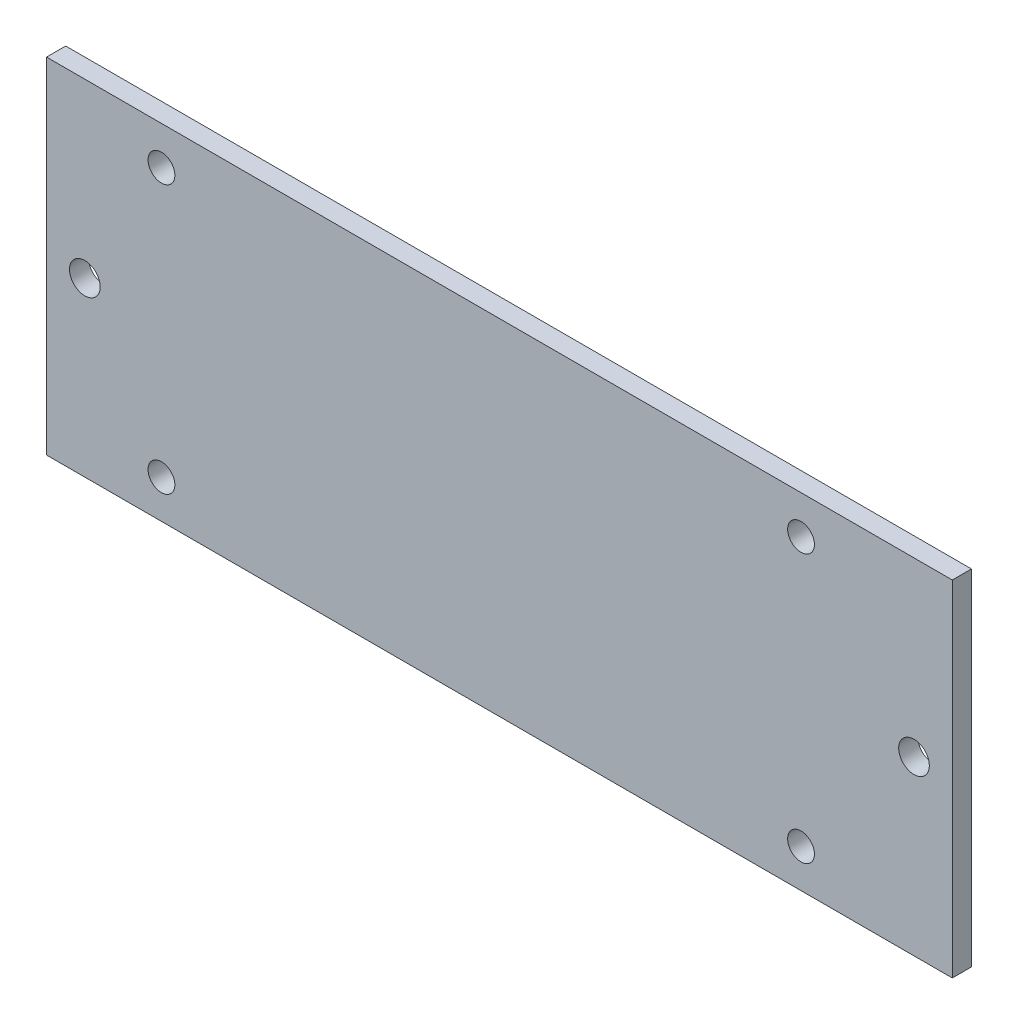
ISO-10303-21;
HEADER;
FILE_DESCRIPTION(('STEP AP214'),'2;1');
FILE_NAME('part.step','',(''),(''),'','','');
FILE_SCHEMA(('AUTOMOTIVE_DESIGN { 1 0 10303 214 1 1 1 1 }'));
ENDSEC;
DATA;
#1=APPLICATION_CONTEXT('core data for automotive mechanical design processes');
#2=APPLICATION_PROTOCOL_DEFINITION('international standard','automotive_design',2000,#1);
#3=PRODUCT_CONTEXT('',#1,'mechanical');
#4=PRODUCT('Part','Part','',(#3));
#5=PRODUCT_RELATED_PRODUCT_CATEGORY('part','',(#4));
#6=PRODUCT_DEFINITION_FORMATION('','',#4);
#7=PRODUCT_DEFINITION_CONTEXT('part definition',#1,'design');
#8=PRODUCT_DEFINITION('design','',#6,#7);
#9=PRODUCT_DEFINITION_SHAPE('','',#8);
#10=(LENGTH_UNIT() NAMED_UNIT(*) SI_UNIT(.MILLI.,.METRE.));
#11=(NAMED_UNIT(*) PLANE_ANGLE_UNIT() SI_UNIT($,.RADIAN.));
#12=(NAMED_UNIT(*) SI_UNIT($,.STERADIAN.) SOLID_ANGLE_UNIT());
#13=UNCERTAINTY_MEASURE_WITH_UNIT(LENGTH_MEASURE(1.E-05),#10,'distance_accuracy_value','');
#14=(GEOMETRIC_REPRESENTATION_CONTEXT(3) GLOBAL_UNCERTAINTY_ASSIGNED_CONTEXT((#13)) GLOBAL_UNIT_ASSIGNED_CONTEXT((#10,
#11,#12)) REPRESENTATION_CONTEXT('',''));
#15=CARTESIAN_POINT('',(0.,0.,0.));
#16=DIRECTION('',(0.,0.,1.));
#17=DIRECTION('',(1.,0.,0.));
#18=AXIS2_PLACEMENT_3D('',#15,#16,#17);
#19=CARTESIAN_POINT('',(-44.9668604651163,18.9503197674418,1.27));
#20=DIRECTION('',(1.,0.,0.));
#21=DIRECTION('',(0.,0.,-1.));
#22=AXIS2_PLACEMENT_3D('',#19,#20,#21);
#23=PLANE('',#22);
#24=DIRECTION('',(0.,-1.,0.));
#25=VECTOR('',#24,1.);
#26=CARTESIAN_POINT('',(-44.9668604651163,18.9503197674418,0.));
#27=LINE('',#26,#25);
#28=CARTESIAN_POINT('',(-44.9668604651163,18.9503197674418,0.));
#29=VERTEX_POINT('',#28);
#30=CARTESIAN_POINT('',(-44.9668604651163,-3.90968023255815,0.));
#31=VERTEX_POINT('',#30);
#32=EDGE_CURVE('E110',#29,#31,#27,.T.);
#33=ORIENTED_EDGE('',*,*,#32,.T.);
#34=DIRECTION('',(0.,0.,-1.));
#35=VECTOR('',#34,1.);
#36=CARTESIAN_POINT('',(-44.9668604651163,-3.90968023255815,1.27));
#37=LINE('',#36,#35);
#38=CARTESIAN_POINT('',(-44.9668604651163,-3.90968023255815,1.27));
#39=VERTEX_POINT('',#38);
#40=EDGE_CURVE('E11',#39,#31,#37,.T.);
#41=ORIENTED_EDGE('',*,*,#40,.F.);
#42=DIRECTION('',(0.,-1.,0.));
#43=VECTOR('',#42,1.);
#44=CARTESIAN_POINT('',(-44.9668604651163,18.9503197674418,1.27));
#45=LINE('',#44,#43);
#46=CARTESIAN_POINT('',(-44.9668604651163,18.9503197674418,1.27));
#47=VERTEX_POINT('',#46);
#48=EDGE_CURVE('E93',#47,#39,#45,.T.);
#49=ORIENTED_EDGE('',*,*,#48,.F.);
#50=DIRECTION('',(0.,0.,-1.));
#51=VECTOR('',#50,1.);
#52=CARTESIAN_POINT('',(-44.9668604651163,18.9503197674418,1.27));
#53=LINE('',#52,#51);
#54=EDGE_CURVE('E106',#47,#29,#53,.T.);
#55=ORIENTED_EDGE('',*,*,#54,.T.);
#56=EDGE_LOOP('',(#33,#41,#49,#55));
#57=FACE_BOUND('',#56,.T.);
#58=ADVANCED_FACE('F39',(#57),#23,.F.);
#59=CARTESIAN_POINT('',(-44.9668604651163,-3.90968023255815,1.27));
#60=DIRECTION('',(0.,1.,0.));
#61=DIRECTION('',(0.,0.,1.));
#62=AXIS2_PLACEMENT_3D('',#59,#60,#61);
#63=PLANE('',#62);
#64=DIRECTION('',(1.,0.,0.));
#65=VECTOR('',#64,1.);
#66=CARTESIAN_POINT('',(-44.9668604651163,-3.90968023255815,0.));
#67=LINE('',#66,#65);
#68=CARTESIAN_POINT('',(15.1041395348837,-3.90968023255815,0.));
#69=VERTEX_POINT('',#68);
#70=EDGE_CURVE('E98',#31,#69,#67,.T.);
#71=ORIENTED_EDGE('',*,*,#70,.T.);
#72=DIRECTION('',(0.,0.,-1.));
#73=VECTOR('',#72,1.);
#74=CARTESIAN_POINT('',(15.1041395348837,-3.90968023255815,1.27));
#75=LINE('',#74,#73);
#76=CARTESIAN_POINT('',(15.1041395348837,-3.90968023255815,1.27));
#77=VERTEX_POINT('',#76);
#78=EDGE_CURVE('E49',#77,#69,#75,.T.);
#79=ORIENTED_EDGE('',*,*,#78,.F.);
#80=DIRECTION('',(1.,0.,0.));
#81=VECTOR('',#80,1.);
#82=CARTESIAN_POINT('',(-44.9668604651163,-3.90968023255815,1.27));
#83=LINE('',#82,#81);
#84=EDGE_CURVE('E88',#39,#77,#83,.T.);
#85=ORIENTED_EDGE('',*,*,#84,.F.);
#86=ORIENTED_EDGE('',*,*,#40,.T.);
#87=EDGE_LOOP('',(#71,#79,#85,#86));
#88=FACE_BOUND('',#87,.T.);
#89=ADVANCED_FACE('F97',(#88),#63,.F.);
#90=CARTESIAN_POINT('',(15.1041395348837,18.9503197674418,1.27));
#91=DIRECTION('',(-1.,0.,0.));
#92=DIRECTION('',(0.,0.,1.));
#93=AXIS2_PLACEMENT_3D('',#90,#91,#92);
#94=PLANE('',#93);
#95=DIRECTION('',(0.,1.,0.));
#96=VECTOR('',#95,1.);
#97=CARTESIAN_POINT('',(15.1041395348837,18.9503197674418,0.));
#98=LINE('',#97,#96);
#99=CARTESIAN_POINT('',(15.1041395348837,18.9503197674418,0.));
#100=VERTEX_POINT('',#99);
#101=EDGE_CURVE('E75',#69,#100,#98,.T.);
#102=ORIENTED_EDGE('',*,*,#101,.T.);
#103=DIRECTION('',(0.,0.,-1.));
#104=VECTOR('',#103,1.);
#105=CARTESIAN_POINT('',(15.1041395348837,18.9503197674418,1.27));
#106=LINE('',#105,#104);
#107=CARTESIAN_POINT('',(15.1041395348837,18.9503197674418,1.27));
#108=VERTEX_POINT('',#107);
#109=EDGE_CURVE('E100',#108,#100,#106,.T.);
#110=ORIENTED_EDGE('',*,*,#109,.F.);
#111=DIRECTION('',(0.,1.,0.));
#112=VECTOR('',#111,1.);
#113=CARTESIAN_POINT('',(15.1041395348837,18.9503197674418,1.27));
#114=LINE('',#113,#112);
#115=EDGE_CURVE('E91',#77,#108,#114,.T.);
#116=ORIENTED_EDGE('',*,*,#115,.F.);
#117=ORIENTED_EDGE('',*,*,#78,.T.);
#118=EDGE_LOOP('',(#102,#110,#116,#117));
#119=FACE_BOUND('',#118,.T.);
#120=ADVANCED_FACE('F102',(#119),#94,.F.);
#121=CARTESIAN_POINT('',(-44.9668604651163,18.9503197674418,1.27));
#122=DIRECTION('',(0.,-1.,0.));
#123=DIRECTION('',(0.,0.,-1.));
#124=AXIS2_PLACEMENT_3D('',#121,#122,#123);
#125=PLANE('',#124);
#126=DIRECTION('',(-1.,0.,0.));
#127=VECTOR('',#126,1.);
#128=CARTESIAN_POINT('',(-44.9668604651163,18.9503197674418,0.));
#129=LINE('',#128,#127);
#130=EDGE_CURVE('E81',#100,#29,#129,.T.);
#131=ORIENTED_EDGE('',*,*,#130,.T.);
#132=ORIENTED_EDGE('',*,*,#54,.F.);
#133=DIRECTION('',(-1.,0.,0.));
#134=VECTOR('',#133,1.);
#135=CARTESIAN_POINT('',(-44.9668604651163,18.9503197674418,1.27));
#136=LINE('',#135,#134);
#137=EDGE_CURVE('E58',#108,#47,#136,.T.);
#138=ORIENTED_EDGE('',*,*,#137,.F.);
#139=ORIENTED_EDGE('',*,*,#109,.T.);
#140=EDGE_LOOP('',(#131,#132,#138,#139));
#141=FACE_BOUND('',#140,.T.);
#142=ADVANCED_FACE('F180',(#141),#125,.F.);
#143=CARTESIAN_POINT('',(0.,0.,1.27));
#144=DIRECTION('',(0.,0.,1.));
#145=DIRECTION('',(1.,0.,0.));
#146=AXIS2_PLACEMENT_3D('',#143,#144,#145);
#147=PLANE('',#146);
#148=CARTESIAN_POINT('',(-42.4268604651163,7.52031976744185,1.27));
#149=DIRECTION('',(0.,0.,1.));
#150=DIRECTION('',(1.,0.,0.));
#151=AXIS2_PLACEMENT_3D('',#148,#149,#150);
#152=CIRCLE('',#151,1.016);
#153=CARTESIAN_POINT('',(-41.4108604651163,7.52031976744185,1.27));
#154=VERTEX_POINT('',#153);
#155=EDGE_CURVE('E129',#154,#154,#152,.T.);
#156=ORIENTED_EDGE('',*,*,#155,.F.);
#157=EDGE_LOOP('',(#156));
#158=FACE_BOUND('',#157,.T.);
#159=CARTESIAN_POINT('',(5.07113953488373,-1.36968023255815,1.27));
#160=DIRECTION('',(0.,0.,1.));
#161=DIRECTION('',(1.,0.,0.));
#162=AXIS2_PLACEMENT_3D('',#159,#160,#161);
#163=CIRCLE('',#162,0.889000000000002);
#164=CARTESIAN_POINT('',(5.96013953488373,-1.36968023255815,1.27));
#165=VERTEX_POINT('',#164);
#166=EDGE_CURVE('E282',#165,#165,#163,.T.);
#167=ORIENTED_EDGE('',*,*,#166,.F.);
#168=EDGE_LOOP('',(#167));
#169=FACE_BOUND('',#168,.T.);
#170=CARTESIAN_POINT('',(12.5641395348837,7.52031976744185,1.27));
#171=DIRECTION('',(0.,0.,1.));
#172=DIRECTION('',(1.,0.,0.));
#173=AXIS2_PLACEMENT_3D('',#170,#171,#172);
#174=CIRCLE('',#173,1.016);
#175=CARTESIAN_POINT('',(13.5801395348837,7.52031976744185,1.27));
#176=VERTEX_POINT('',#175);
#177=EDGE_CURVE('E254',#176,#176,#174,.T.);
#178=ORIENTED_EDGE('',*,*,#177,.F.);
#179=EDGE_LOOP('',(#178));
#180=FACE_BOUND('',#179,.T.);
#181=CARTESIAN_POINT('',(-37.3468604651163,16.4103197674418,1.27));
#182=DIRECTION('',(0.,0.,1.));
#183=DIRECTION('',(1.,0.,0.));
#184=AXIS2_PLACEMENT_3D('',#181,#182,#183);
#185=CIRCLE('',#184,0.889000000000003);
#186=CARTESIAN_POINT('',(-36.4578604651163,16.4103197674418,1.27));
#187=VERTEX_POINT('',#186);
#188=EDGE_CURVE('E268',#187,#187,#185,.T.);
#189=ORIENTED_EDGE('',*,*,#188,.F.);
#190=EDGE_LOOP('',(#189));
#191=FACE_BOUND('',#190,.T.);
#192=CARTESIAN_POINT('',(5.07113953488373,16.4103197674418,1.27));
#193=DIRECTION('',(0.,0.,1.));
#194=DIRECTION('',(1.,0.,0.));
#195=AXIS2_PLACEMENT_3D('',#192,#193,#194);
#196=CIRCLE('',#195,0.889000000000002);
#197=CARTESIAN_POINT('',(5.96013953488373,16.4103197674418,1.27));
#198=VERTEX_POINT('',#197);
#199=EDGE_CURVE('E274',#198,#198,#196,.T.);
#200=ORIENTED_EDGE('',*,*,#199,.F.);
#201=EDGE_LOOP('',(#200));
#202=FACE_BOUND('',#201,.T.);
#203=CARTESIAN_POINT('',(-37.3468604651163,-1.36968023255815,1.27));
#204=DIRECTION('',(0.,0.,1.));
#205=DIRECTION('',(1.,0.,0.));
#206=AXIS2_PLACEMENT_3D('',#203,#204,#205);
#207=CIRCLE('',#206,0.889000000000003);
#208=CARTESIAN_POINT('',(-36.4578604651163,-1.36968023255815,1.27));
#209=VERTEX_POINT('',#208);
#210=EDGE_CURVE('E277',#209,#209,#207,.T.);
#211=ORIENTED_EDGE('',*,*,#210,.F.);
#212=EDGE_LOOP('',(#211));
#213=FACE_BOUND('',#212,.T.);
#214=ORIENTED_EDGE('',*,*,#48,.T.);
#215=ORIENTED_EDGE('',*,*,#84,.T.);
#216=ORIENTED_EDGE('',*,*,#115,.T.);
#217=ORIENTED_EDGE('',*,*,#137,.T.);
#218=EDGE_LOOP('',(#214,#215,#216,#217));
#219=FACE_BOUND('',#218,.T.);
#220=ADVANCED_FACE('F89',(#158,#169,#180,#191,#202,#213,#219),#147,.T.);
#221=CARTESIAN_POINT('',(0.,0.,0.));
#222=DIRECTION('',(0.,0.,1.));
#223=DIRECTION('',(1.,0.,0.));
#224=AXIS2_PLACEMENT_3D('',#221,#222,#223);
#225=PLANE('',#224);
#226=CARTESIAN_POINT('',(-42.4268604651163,7.52031976744185,0.));
#227=DIRECTION('',(0.,0.,1.));
#228=DIRECTION('',(1.,0.,0.));
#229=AXIS2_PLACEMENT_3D('',#226,#227,#228);
#230=CIRCLE('',#229,1.016);
#231=CARTESIAN_POINT('',(-41.4108604651163,7.52031976744185,0.));
#232=VERTEX_POINT('',#231);
#233=EDGE_CURVE('E42',#232,#232,#230,.T.);
#234=ORIENTED_EDGE('',*,*,#233,.T.);
#235=EDGE_LOOP('',(#234));
#236=FACE_BOUND('',#235,.T.);
#237=CARTESIAN_POINT('',(5.07113953488373,-1.36968023255815,0.));
#238=DIRECTION('',(0.,0.,1.));
#239=DIRECTION('',(1.,0.,0.));
#240=AXIS2_PLACEMENT_3D('',#237,#238,#239);
#241=CIRCLE('',#240,0.889000000000002);
#242=CARTESIAN_POINT('',(5.96013953488373,-1.36968023255815,0.));
#243=VERTEX_POINT('',#242);
#244=EDGE_CURVE('E140',#243,#243,#241,.T.);
#245=ORIENTED_EDGE('',*,*,#244,.T.);
#246=EDGE_LOOP('',(#245));
#247=FACE_BOUND('',#246,.T.);
#248=CARTESIAN_POINT('',(12.5641395348837,7.52031976744185,0.));
#249=DIRECTION('',(0.,0.,1.));
#250=DIRECTION('',(1.,0.,0.));
#251=AXIS2_PLACEMENT_3D('',#248,#249,#250);
#252=CIRCLE('',#251,1.016);
#253=CARTESIAN_POINT('',(13.5801395348837,7.52031976744185,0.));
#254=VERTEX_POINT('',#253);
#255=EDGE_CURVE('E137',#254,#254,#252,.T.);
#256=ORIENTED_EDGE('',*,*,#255,.T.);
#257=EDGE_LOOP('',(#256));
#258=FACE_BOUND('',#257,.T.);
#259=CARTESIAN_POINT('',(-37.3468604651163,16.4103197674418,0.));
#260=DIRECTION('',(0.,0.,1.));
#261=DIRECTION('',(1.,0.,0.));
#262=AXIS2_PLACEMENT_3D('',#259,#260,#261);
#263=CIRCLE('',#262,0.889000000000003);
#264=CARTESIAN_POINT('',(-36.4578604651163,16.4103197674418,0.));
#265=VERTEX_POINT('',#264);
#266=EDGE_CURVE('E133',#265,#265,#263,.T.);
#267=ORIENTED_EDGE('',*,*,#266,.T.);
#268=EDGE_LOOP('',(#267));
#269=FACE_BOUND('',#268,.T.);
#270=CARTESIAN_POINT('',(5.07113953488373,16.4103197674418,0.));
#271=DIRECTION('',(0.,0.,1.));
#272=DIRECTION('',(1.,0.,0.));
#273=AXIS2_PLACEMENT_3D('',#270,#271,#272);
#274=CIRCLE('',#273,0.889000000000002);
#275=CARTESIAN_POINT('',(5.96013953488373,16.4103197674418,0.));
#276=VERTEX_POINT('',#275);
#277=EDGE_CURVE('E128',#276,#276,#274,.T.);
#278=ORIENTED_EDGE('',*,*,#277,.T.);
#279=EDGE_LOOP('',(#278));
#280=FACE_BOUND('',#279,.T.);
#281=CARTESIAN_POINT('',(-37.3468604651163,-1.36968023255815,0.));
#282=DIRECTION('',(0.,0.,1.));
#283=DIRECTION('',(1.,0.,0.));
#284=AXIS2_PLACEMENT_3D('',#281,#282,#283);
#285=CIRCLE('',#284,0.889000000000003);
#286=CARTESIAN_POINT('',(-36.4578604651163,-1.36968023255815,0.));
#287=VERTEX_POINT('',#286);
#288=EDGE_CURVE('E124',#287,#287,#285,.T.);
#289=ORIENTED_EDGE('',*,*,#288,.T.);
#290=EDGE_LOOP('',(#289));
#291=FACE_BOUND('',#290,.T.);
#292=ORIENTED_EDGE('',*,*,#32,.F.);
#293=ORIENTED_EDGE('',*,*,#130,.F.);
#294=ORIENTED_EDGE('',*,*,#101,.F.);
#295=ORIENTED_EDGE('',*,*,#70,.F.);
#296=EDGE_LOOP('',(#292,#293,#294,#295));
#297=FACE_BOUND('',#296,.T.);
#298=ADVANCED_FACE('F149',(#236,#247,#258,#269,#280,#291,#297),#225,.F.);
#299=CARTESIAN_POINT('',(-37.3468604651163,-1.36968023255815,-1.27));
#300=DIRECTION('',(0.,0.,1.));
#301=DIRECTION('',(1.,0.,0.));
#302=AXIS2_PLACEMENT_3D('',#299,#300,#301);
#303=CYLINDRICAL_SURFACE('',#302,0.889000000000003);
#304=ORIENTED_EDGE('',*,*,#210,.T.);
#305=EDGE_LOOP('',(#304));
#306=FACE_BOUND('',#305,.T.);
#307=ORIENTED_EDGE('',*,*,#288,.F.);
#308=EDGE_LOOP('',(#307));
#309=FACE_BOUND('',#308,.T.);
#310=ADVANCED_FACE('F171',(#306,#309),#303,.F.);
#311=CARTESIAN_POINT('',(5.07113953488373,16.4103197674418,-1.27));
#312=DIRECTION('',(0.,0.,1.));
#313=DIRECTION('',(1.,0.,0.));
#314=AXIS2_PLACEMENT_3D('',#311,#312,#313);
#315=CYLINDRICAL_SURFACE('',#314,0.889000000000002);
#316=ORIENTED_EDGE('',*,*,#199,.T.);
#317=EDGE_LOOP('',(#316));
#318=FACE_BOUND('',#317,.T.);
#319=ORIENTED_EDGE('',*,*,#277,.F.);
#320=EDGE_LOOP('',(#319));
#321=FACE_BOUND('',#320,.T.);
#322=ADVANCED_FACE('F177',(#318,#321),#315,.F.);
#323=CARTESIAN_POINT('',(-37.3468604651163,16.4103197674418,-1.27));
#324=DIRECTION('',(0.,0.,1.));
#325=DIRECTION('',(1.,0.,0.));
#326=AXIS2_PLACEMENT_3D('',#323,#324,#325);
#327=CYLINDRICAL_SURFACE('',#326,0.889000000000003);
#328=ORIENTED_EDGE('',*,*,#188,.T.);
#329=EDGE_LOOP('',(#328));
#330=FACE_BOUND('',#329,.T.);
#331=ORIENTED_EDGE('',*,*,#266,.F.);
#332=EDGE_LOOP('',(#331));
#333=FACE_BOUND('',#332,.T.);
#334=ADVANCED_FACE('F219',(#330,#333),#327,.F.);
#335=CARTESIAN_POINT('',(12.5641395348837,7.52031976744185,-1.27));
#336=DIRECTION('',(0.,0.,1.));
#337=DIRECTION('',(1.,0.,0.));
#338=AXIS2_PLACEMENT_3D('',#335,#336,#337);
#339=CYLINDRICAL_SURFACE('',#338,1.016);
#340=ORIENTED_EDGE('',*,*,#177,.T.);
#341=EDGE_LOOP('',(#340));
#342=FACE_BOUND('',#341,.T.);
#343=ORIENTED_EDGE('',*,*,#255,.F.);
#344=EDGE_LOOP('',(#343));
#345=FACE_BOUND('',#344,.T.);
#346=ADVANCED_FACE('F159',(#342,#345),#339,.F.);
#347=CARTESIAN_POINT('',(5.07113953488373,-1.36968023255815,-1.27));
#348=DIRECTION('',(0.,0.,1.));
#349=DIRECTION('',(1.,0.,0.));
#350=AXIS2_PLACEMENT_3D('',#347,#348,#349);
#351=CYLINDRICAL_SURFACE('',#350,0.889000000000002);
#352=ORIENTED_EDGE('',*,*,#166,.T.);
#353=EDGE_LOOP('',(#352));
#354=FACE_BOUND('',#353,.T.);
#355=ORIENTED_EDGE('',*,*,#244,.F.);
#356=EDGE_LOOP('',(#355));
#357=FACE_BOUND('',#356,.T.);
#358=ADVANCED_FACE('F153',(#354,#357),#351,.F.);
#359=CARTESIAN_POINT('',(-42.4268604651163,7.52031976744185,-1.27));
#360=DIRECTION('',(0.,0.,1.));
#361=DIRECTION('',(1.,0.,0.));
#362=AXIS2_PLACEMENT_3D('',#359,#360,#361);
#363=CYLINDRICAL_SURFACE('',#362,1.016);
#364=ORIENTED_EDGE('',*,*,#155,.T.);
#365=EDGE_LOOP('',(#364));
#366=FACE_BOUND('',#365,.T.);
#367=ORIENTED_EDGE('',*,*,#233,.F.);
#368=EDGE_LOOP('',(#367));
#369=FACE_BOUND('',#368,.T.);
#370=ADVANCED_FACE('F151',(#366,#369),#363,.F.);
#371=CLOSED_SHELL('',(#58,#89,#120,#142,#220,#298,#310,#322,#334,#346,#358,#370));
#372=MANIFOLD_SOLID_BREP('B2',#371);
#373=ADVANCED_BREP_SHAPE_REPRESENTATION('',(#18,#372),#14);
#374=SHAPE_DEFINITION_REPRESENTATION(#9,#373);
ENDSEC;
END-ISO-10303-21;
